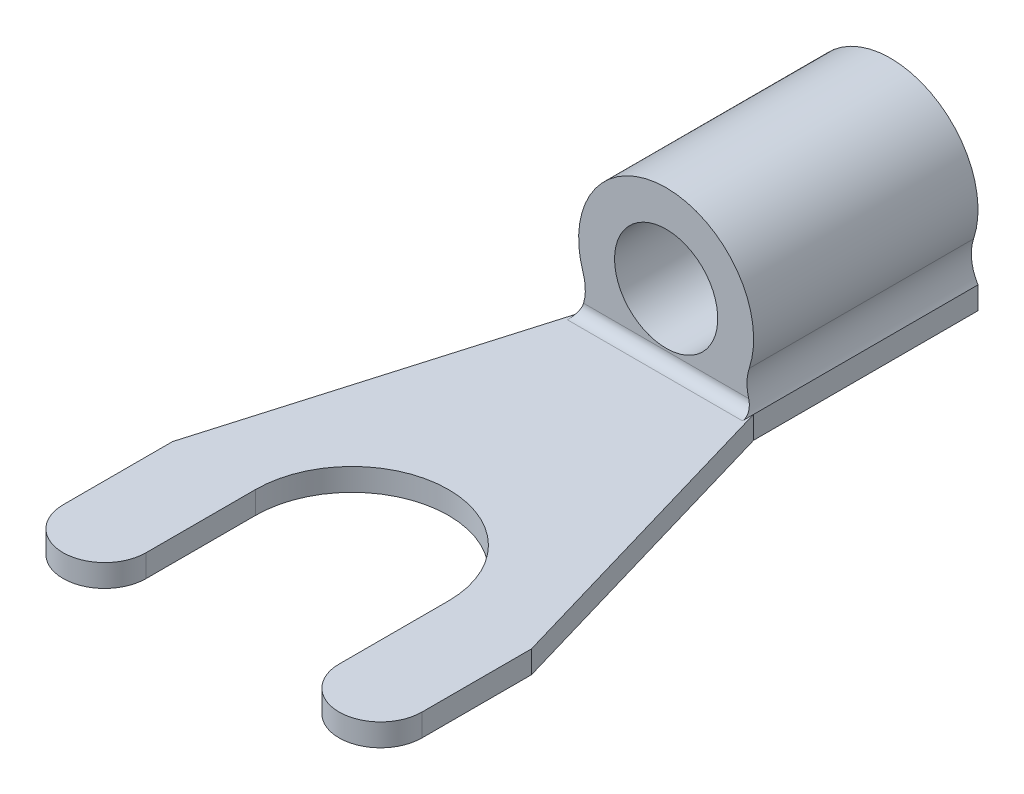
ISO-10303-21;
HEADER;
FILE_DESCRIPTION(('STEP AP214'),'2;1');
FILE_NAME('part.step','',(''),(''),'','','');
FILE_SCHEMA(('AUTOMOTIVE_DESIGN { 1 0 10303 214 1 1 1 1 }'));
ENDSEC;
DATA;
#1=APPLICATION_CONTEXT('core data for automotive mechanical design processes');
#2=APPLICATION_PROTOCOL_DEFINITION('international standard','automotive_design',2000,#1);
#3=PRODUCT_CONTEXT('',#1,'mechanical');
#4=PRODUCT('Part','Part','',(#3));
#5=PRODUCT_RELATED_PRODUCT_CATEGORY('part','',(#4));
#6=PRODUCT_DEFINITION_FORMATION('','',#4);
#7=PRODUCT_DEFINITION_CONTEXT('part definition',#1,'design');
#8=PRODUCT_DEFINITION('design','',#6,#7);
#9=PRODUCT_DEFINITION_SHAPE('','',#8);
#10=(LENGTH_UNIT() NAMED_UNIT(*) SI_UNIT(.MILLI.,.METRE.));
#11=(NAMED_UNIT(*) PLANE_ANGLE_UNIT() SI_UNIT($,.RADIAN.));
#12=(NAMED_UNIT(*) SI_UNIT($,.STERADIAN.) SOLID_ANGLE_UNIT());
#13=UNCERTAINTY_MEASURE_WITH_UNIT(LENGTH_MEASURE(1.E-05),#10,'distance_accuracy_value','');
#14=(GEOMETRIC_REPRESENTATION_CONTEXT(3) GLOBAL_UNCERTAINTY_ASSIGNED_CONTEXT((#13)) GLOBAL_UNIT_ASSIGNED_CONTEXT((#10,
#11,#12)) REPRESENTATION_CONTEXT('',''));
#15=CARTESIAN_POINT('',(0.,0.,0.));
#16=DIRECTION('',(0.,0.,1.));
#17=DIRECTION('',(1.,0.,0.));
#18=AXIS2_PLACEMENT_3D('',#15,#16,#17);
#19=CARTESIAN_POINT('',(-17.8518164707155,-12.39497293494,184.830362795075));
#20=DIRECTION('',(-1.,0.,0.));
#21=DIRECTION('',(0.,0.,1.));
#22=AXIS2_PLACEMENT_3D('',#19,#20,#21);
#23=CYLINDRICAL_SURFACE('',#22,0.25);
#24=DIRECTION('',(-1.,0.,0.));
#25=VECTOR('',#24,1.);
#26=CARTESIAN_POINT('',(-17.8518164707155,-12.39497293494,184.580362795075));
#27=LINE('',#26,#25);
#28=CARTESIAN_POINT('',(-16.0121147430241,-12.39497293494,184.580362795075));
#29=VERTEX_POINT('',#28);
#30=CARTESIAN_POINT('',(-19.691518198407,-12.39497293494,184.580362795075));
#31=VERTEX_POINT('',#30);
#32=EDGE_CURVE('E156',#29,#31,#27,.T.);
#33=ORIENTED_EDGE('',*,*,#32,.T.);
#34=CARTESIAN_POINT('',(-19.8018164707156,-12.64497293494,184.830362795075));
#35=CARTESIAN_POINT('',(-19.8018349927325,-12.6449894328581,184.817570142876));
#36=CARTESIAN_POINT('',(-19.8012116684408,-12.6439923351435,184.804799489349));
#37=CARTESIAN_POINT('',(-19.7988337437832,-12.6401132034944,184.779727326436));
#38=CARTESIAN_POINT('',(-19.7970855808868,-12.6372418943593,184.767423566683));
#39=CARTESIAN_POINT('',(-19.7926110260285,-12.6297600230375,184.74357719183));
#40=CARTESIAN_POINT('',(-19.789886276328,-12.6251523800636,184.732033337193));
#41=CARTESIAN_POINT('',(-19.7836747861377,-12.6143845328763,184.709904926417));
#42=CARTESIAN_POINT('',(-19.7801870435434,-12.6082222852197,184.699321658009));
#43=CARTESIAN_POINT('',(-19.7723885116579,-12.5940178253139,184.678535926885));
#44=CARTESIAN_POINT('',(-19.7680354544514,-12.5858687735941,184.668422601686));
#45=CARTESIAN_POINT('',(-19.758963473874,-12.5682088581191,184.649654392703));
#46=CARTESIAN_POINT('',(-19.7542443749778,-12.5586973391563,184.641000215004));
#47=CARTESIAN_POINT('',(-19.7440540767601,-12.5372088015942,184.62426236939));
#48=CARTESIAN_POINT('',(-19.7385640711199,-12.5250720270503,184.616394399563));
#49=CARTESIAN_POINT('',(-19.7276992950494,-12.4995918327456,184.602847934426));
#50=CARTESIAN_POINT('',(-19.7223244778042,-12.4862489151499,184.597168533065));
#51=CARTESIAN_POINT('',(-19.7124799520318,-12.4600973711964,184.588645199829));
#52=CARTESIAN_POINT('',(-19.707974353849,-12.4473786179252,184.585566982954));
#53=CARTESIAN_POINT('',(-19.6993894524078,-12.4214642011762,184.581422570374));
#54=CARTESIAN_POINT('',(-19.6953106222314,-12.408268029819,184.580358585627));
#55=CARTESIAN_POINT('',(-19.691518198407,-12.39497293494,184.580362795075));
#56=B_SPLINE_CURVE_WITH_KNOTS('',3,(#34,#35,#36,#37,#38,#39,#40,#41,#42,#43,#44,#45,#46,#47,#48,
#49,#50,#51,#52,#53,#54,#55),.UNSPECIFIED.,.F.,.F.,(4,2,2,2,2,2,2,2,2,2,4),(0.,
0.0382893069018732,0.0763614093332975,0.114369786533513,0.152428386377287,0.193361552979245,
0.234314470757119,0.280522325949232,0.326711030823084,0.368073046255088,0.409480437175451),.UNSPECIFIED.);
#57=CARTESIAN_POINT('',(-19.8018164707156,-12.64497293494,184.830362795075));
#58=VERTEX_POINT('',#57);
#59=EDGE_CURVE('E40',#58,#31,#56,.T.);
#60=ORIENTED_EDGE('',*,*,#59,.F.);
#61=DIRECTION('',(1.,0.,0.));
#62=VECTOR('',#61,1.);
#63=CARTESIAN_POINT('',(-17.8518164707155,-12.64497293494,184.830362795075));
#64=LINE('',#63,#62);
#65=CARTESIAN_POINT('',(-15.9018164707155,-12.64497293494,184.830362795075));
#66=VERTEX_POINT('',#65);
#67=EDGE_CURVE('E153',#66,#58,#64,.F.);
#68=ORIENTED_EDGE('',*,*,#67,.F.);
#69=CARTESIAN_POINT('',(-16.0121147430241,-12.39497293494,184.580362795075));
#70=CARTESIAN_POINT('',(-16.0078761505968,-12.4098451381497,184.580356274));
#71=CARTESIAN_POINT('',(-16.0032751001696,-12.4245902749962,184.58168852066));
#72=CARTESIAN_POINT('',(-15.9935663406919,-12.4534221676546,184.586853884942));
#73=CARTESIAN_POINT('',(-15.9884599853089,-12.4675105413361,184.590680466472));
#74=CARTESIAN_POINT('',(-15.9779411647647,-12.494689150805,184.600653368463));
#75=CARTESIAN_POINT('',(-15.9725290891962,-12.5077806091616,184.606796790747));
#76=CARTESIAN_POINT('',(-15.9616442840161,-12.5327098951477,184.621230999046));
#77=CARTESIAN_POINT('',(-15.9561715035853,-12.5445465684715,184.629523738524));
#78=CARTESIAN_POINT('',(-15.9452498907144,-12.5671215219745,184.648455009797));
#79=CARTESIAN_POINT('',(-15.9398105969283,-12.5777977078572,184.659173460593));
#80=CARTESIAN_POINT('',(-15.9295718025825,-12.597165129548,184.682550664264));
#81=CARTESIAN_POINT('',(-15.924772267461,-12.6058564726014,184.695209312244));
#82=CARTESIAN_POINT('',(-15.9164554193761,-12.6205238966397,184.721537853493));
#83=CARTESIAN_POINT('',(-15.9128874505239,-12.6266106686319,184.735129586804));
#84=CARTESIAN_POINT('',(-15.90711977162,-12.6363051415058,184.763424969605));
#85=CARTESIAN_POINT('',(-15.9049159364692,-12.6399203199117,184.778125114532));
#86=CARTESIAN_POINT('',(-15.9029651406894,-12.6431064240035,184.799236527183));
#87=CARTESIAN_POINT('',(-15.9025355816201,-12.6438053194982,184.805433809102));
#88=CARTESIAN_POINT('',(-15.9019611387333,-12.6447384616291,184.817873563688));
#89=CARTESIAN_POINT('',(-15.9018161301016,-12.6449729119884,184.824116015334));
#90=CARTESIAN_POINT('',(-15.9018164707155,-12.64497293494,184.830362795075));
#91=B_SPLINE_CURVE_WITH_KNOTS('',3,(#69,#70,#71,#72,#73,#74,#75,#76,#77,#78,#79,#80,#81,#82,#83,
#84,#85,#86,#87,#88,#89,#90),.UNSPECIFIED.,.F.,.F.,(4,2,2,2,2,2,2,2,2,2,4),(0.,
0.0462989373863122,0.0924770392758487,0.138597566715187,0.184760159896985,0.232751610935657,
0.280740468279888,0.326416072227263,0.371952870974996,0.390686940772957,0.409412791278961),.UNSPECIFIED.);
#92=EDGE_CURVE('E161',#29,#66,#91,.T.);
#93=ORIENTED_EDGE('',*,*,#92,.F.);
#94=EDGE_LOOP('',(#33,#60,#68,#93));
#95=FACE_BOUND('',#94,.T.);
#96=ADVANCED_FACE('F36',(#95),#23,.F.);
#97=CARTESIAN_POINT('',(-17.8518164707155,-11.19497293494,184.580362795075));
#98=DIRECTION('',(0.,0.,-1.));
#99=DIRECTION('',(-1.,0.,0.));
#100=AXIS2_PLACEMENT_3D('',#97,#98,#99);
#101=CYLINDRICAL_SURFACE('',#100,1.15);
#102=CARTESIAN_POINT('',(-17.8518164707155,-11.19497293494,179.930362795101));
#103=DIRECTION('',(0.,0.,-1.));
#104=DIRECTION('',(-1.,0.,0.));
#105=AXIS2_PLACEMENT_3D('',#102,#103,#104);
#106=CIRCLE('',#105,1.14999999999554);
#107=CARTESIAN_POINT('',(-19.0018164707111,-11.19497293494,179.930362795101));
#108=VERTEX_POINT('',#107);
#109=EDGE_CURVE('E245',#108,#108,#106,.T.);
#110=ORIENTED_EDGE('',*,*,#109,.T.);
#111=EDGE_LOOP('',(#110));
#112=FACE_BOUND('',#111,.T.);
#113=CARTESIAN_POINT('',(-17.8518164707155,-11.19497293494,184.580362795075));
#114=DIRECTION('',(0.,0.,-1.));
#115=DIRECTION('',(-1.,0.,0.));
#116=AXIS2_PLACEMENT_3D('',#113,#114,#115);
#117=CIRCLE('',#116,1.15);
#118=CARTESIAN_POINT('',(-19.0018164707155,-11.19497293494,184.580362795075));
#119=VERTEX_POINT('',#118);
#120=EDGE_CURVE('E171',#119,#119,#117,.F.);
#121=ORIENTED_EDGE('',*,*,#120,.T.);
#122=EDGE_LOOP('',(#121));
#123=FACE_BOUND('',#122,.T.);
#124=ADVANCED_FACE('F299',(#112,#123),#101,.F.);
#125=CARTESIAN_POINT('',(-17.8518164707155,-11.19497293494,184.580362795075));
#126=DIRECTION('',(0.,0.,-1.));
#127=DIRECTION('',(-1.,0.,0.));
#128=AXIS2_PLACEMENT_3D('',#125,#126,#127);
#129=PLANE('',#128);
#130=ORIENTED_EDGE('',*,*,#120,.F.);
#131=EDGE_LOOP('',(#130));
#132=FACE_BOUND('',#131,.T.);
#133=ORIENTED_EDGE('',*,*,#32,.F.);
#134=CARTESIAN_POINT('',(-15.0506327160756,-12.1201051269759,184.580362795075));
#135=DIRECTION('',(0.,0.,1.));
#136=DIRECTION('',(1.,0.,0.));
#137=AXIS2_PLACEMENT_3D('',#134,#135,#136);
#138=CIRCLE('',#137,1.);
#139=CARTESIAN_POINT('',(-16.0001865312078,-11.8065009940824,184.580362795075));
#140=VERTEX_POINT('',#139);
#141=EDGE_CURVE('E212',#29,#140,#138,.F.);
#142=ORIENTED_EDGE('',*,*,#141,.T.);
#143=CARTESIAN_POINT('',(-17.8518164707155,-11.19497293494,184.580362795075));
#144=DIRECTION('',(0.,0.,-1.));
#145=DIRECTION('',(-1.,0.,0.));
#146=AXIS2_PLACEMENT_3D('',#143,#144,#145);
#147=CIRCLE('',#146,1.95);
#148=CARTESIAN_POINT('',(-19.7034464102233,-11.8065009940824,184.580362795075));
#149=VERTEX_POINT('',#148);
#150=EDGE_CURVE('E182',#149,#140,#147,.T.);
#151=ORIENTED_EDGE('',*,*,#150,.F.);
#152=CARTESIAN_POINT('',(-20.6530002253555,-12.1201051269759,184.580362795075));
#153=DIRECTION('',(0.,0.,-1.));
#154=DIRECTION('',(-1.,0.,0.));
#155=AXIS2_PLACEMENT_3D('',#152,#153,#154);
#156=CIRCLE('',#155,1.);
#157=EDGE_CURVE('E244',#31,#149,#156,.F.);
#158=ORIENTED_EDGE('',*,*,#157,.F.);
#159=EDGE_LOOP('',(#133,#142,#151,#158));
#160=FACE_BOUND('',#159,.T.);
#161=ADVANCED_FACE('F297',(#132,#160),#129,.F.);
#162=CARTESIAN_POINT('',(-17.8518164707155,-12.64497293494,191.580362795075));
#163=DIRECTION('',(0.,1.,0.));
#164=DIRECTION('',(1.,0.,0.));
#165=AXIS2_PLACEMENT_3D('',#162,#163,#164);
#166=PLANE('',#165);
#167=DIRECTION('',(0.281052751161895,0.,0.959692321040619));
#168=VECTOR('',#167,1.);
#169=CARTESIAN_POINT('',(-14.1677790664582,-12.64497293494,190.501466126686));
#170=LINE('',#169,#168);
#171=CARTESIAN_POINT('',(-13.8518164707155,-12.64497293494,191.580362795075));
#172=VERTEX_POINT('',#171);
#173=CARTESIAN_POINT('',(-15.9018164707155,-12.64497293494,184.580362795075));
#174=VERTEX_POINT('',#173);
#175=EDGE_CURVE('E218',#172,#174,#170,.F.);
#176=ORIENTED_EDGE('',*,*,#175,.T.);
#177=DIRECTION('',(0.,0.,1.));
#178=VECTOR('',#177,1.);
#179=CARTESIAN_POINT('',(-15.9018164707155,-12.64497293494,191.580362795075));
#180=LINE('',#179,#178);
#181=EDGE_CURVE('E169',#174,#66,#180,.T.);
#182=ORIENTED_EDGE('',*,*,#181,.T.);
#183=ORIENTED_EDGE('',*,*,#67,.T.);
#184=DIRECTION('',(0.,0.,-1.));
#185=VECTOR('',#184,1.);
#186=CARTESIAN_POINT('',(-19.8018164707156,-12.64497293494,191.580362795075));
#187=LINE('',#186,#185);
#188=CARTESIAN_POINT('',(-19.8018164707156,-12.64497293494,184.580362795075));
#189=VERTEX_POINT('',#188);
#190=EDGE_CURVE('E167',#58,#189,#187,.T.);
#191=ORIENTED_EDGE('',*,*,#190,.T.);
#192=DIRECTION('',(0.281052751161895,0.,-0.959692321040619));
#193=VECTOR('',#192,1.);
#194=CARTESIAN_POINT('',(-21.5358538749729,-12.64497293494,190.501466126686));
#195=LINE('',#194,#193);
#196=CARTESIAN_POINT('',(-21.8518164707155,-12.64497293494,191.580362795075));
#197=VERTEX_POINT('',#196);
#198=EDGE_CURVE('E176',#189,#197,#195,.F.);
#199=ORIENTED_EDGE('',*,*,#198,.T.);
#200=DIRECTION('',(0.,0.,1.));
#201=VECTOR('',#200,1.);
#202=CARTESIAN_POINT('',(-21.8518164707155,-12.64497293494,191.580362795075));
#203=LINE('',#202,#201);
#204=CARTESIAN_POINT('',(-21.8518164707155,-12.64497293494,194.019624978606));
#205=VERTEX_POINT('',#204);
#206=EDGE_CURVE('E179',#205,#197,#203,.F.);
#207=ORIENTED_EDGE('',*,*,#206,.F.);
#208=CARTESIAN_POINT('',(-20.9268164707155,-12.64497293494,194.019624978606));
#209=DIRECTION('',(0.,-1.,0.));
#210=DIRECTION('',(-1.,0.,0.));
#211=AXIS2_PLACEMENT_3D('',#208,#209,#210);
#212=CIRCLE('',#211,0.925);
#213=CARTESIAN_POINT('',(-20.0018164707156,-12.64497293494,194.019624978606));
#214=VERTEX_POINT('',#213);
#215=EDGE_CURVE('E274',#214,#205,#212,.T.);
#216=ORIENTED_EDGE('',*,*,#215,.F.);
#217=DIRECTION('',(0.,0.,-1.));
#218=VECTOR('',#217,1.);
#219=CARTESIAN_POINT('',(-20.0018164707155,-12.64497293494,191.580362795075));
#220=LINE('',#219,#218);
#221=CARTESIAN_POINT('',(-20.0018164707155,-12.64497293494,191.580362795075));
#222=VERTEX_POINT('',#221);
#223=EDGE_CURVE('E235',#222,#214,#220,.F.);
#224=ORIENTED_EDGE('',*,*,#223,.F.);
#225=CARTESIAN_POINT('',(-17.8518164707155,-12.64497293494,191.580362795075));
#226=DIRECTION('',(0.,-1.,0.));
#227=DIRECTION('',(-1.,0.,0.));
#228=AXIS2_PLACEMENT_3D('',#225,#226,#227);
#229=CIRCLE('',#228,2.15);
#230=CARTESIAN_POINT('',(-15.7018164707156,-12.64497293494,191.580362795075));
#231=VERTEX_POINT('',#230);
#232=EDGE_CURVE('E271',#222,#231,#229,.T.);
#233=ORIENTED_EDGE('',*,*,#232,.T.);
#234=DIRECTION('',(0.,0.,-1.));
#235=VECTOR('',#234,1.);
#236=CARTESIAN_POINT('',(-15.7018164707156,-12.64497293494,191.580362795075));
#237=LINE('',#236,#235);
#238=CARTESIAN_POINT('',(-15.7018164707155,-12.64497293494,194.019624978606));
#239=VERTEX_POINT('',#238);
#240=EDGE_CURVE('E230',#231,#239,#237,.F.);
#241=ORIENTED_EDGE('',*,*,#240,.T.);
#242=CARTESIAN_POINT('',(-14.7768164707155,-12.64497293494,194.019624978606));
#243=DIRECTION('',(0.,-1.,0.));
#244=DIRECTION('',(-1.,0.,0.));
#245=AXIS2_PLACEMENT_3D('',#242,#243,#244);
#246=CIRCLE('',#245,0.925);
#247=CARTESIAN_POINT('',(-13.8518164707155,-12.64497293494,194.019624978606));
#248=VERTEX_POINT('',#247);
#249=EDGE_CURVE('E233',#248,#239,#246,.T.);
#250=ORIENTED_EDGE('',*,*,#249,.F.);
#251=DIRECTION('',(0.,0.,1.));
#252=VECTOR('',#251,1.);
#253=CARTESIAN_POINT('',(-13.8518164707155,-12.64497293494,191.580362795075));
#254=LINE('',#253,#252);
#255=EDGE_CURVE('E225',#248,#172,#254,.F.);
#256=ORIENTED_EDGE('',*,*,#255,.T.);
#257=EDGE_LOOP('',(#176,#182,#183,#191,#199,#207,#216,#224,#233,#241,#250,#256));
#258=FACE_BOUND('',#257,.T.);
#259=ADVANCED_FACE('F165',(#258),#166,.T.);
#260=CARTESIAN_POINT('',(-15.0506327160756,-12.1201051269759,191.580362795075));
#261=DIRECTION('',(0.,0.,1.));
#262=DIRECTION('',(1.,0.,0.));
#263=AXIS2_PLACEMENT_3D('',#260,#261,#262);
#264=CYLINDRICAL_SURFACE('',#263,1.);
#265=ORIENTED_EDGE('',*,*,#92,.T.);
#266=ORIENTED_EDGE('',*,*,#181,.F.);
#267=DIRECTION('',(0.,0.,1.));
#268=VECTOR('',#267,1.);
#269=CARTESIAN_POINT('',(-15.9018164707155,-12.64497293494,191.580362795075));
#270=LINE('',#269,#268);
#271=CARTESIAN_POINT('',(-15.9018164707155,-12.64497293494,179.580362795075));
#272=VERTEX_POINT('',#271);
#273=EDGE_CURVE('E199',#174,#272,#270,.F.);
#274=ORIENTED_EDGE('',*,*,#273,.T.);
#275=CARTESIAN_POINT('',(-15.0506327160756,-12.1201051269759,179.580362795075));
#276=DIRECTION('',(0.,0.,1.));
#277=DIRECTION('',(1.,0.,0.));
#278=AXIS2_PLACEMENT_3D('',#275,#276,#277);
#279=CIRCLE('',#278,1.);
#280=CARTESIAN_POINT('',(-16.0001865312078,-11.8065009940824,179.580362795075));
#281=VERTEX_POINT('',#280);
#282=EDGE_CURVE('E213',#281,#272,#279,.T.);
#283=ORIENTED_EDGE('',*,*,#282,.F.);
#284=DIRECTION('',(0.,0.,1.));
#285=VECTOR('',#284,1.);
#286=CARTESIAN_POINT('',(-16.0001865312078,-11.8065009940824,191.580362795075));
#287=LINE('',#286,#285);
#288=EDGE_CURVE('E170',#140,#281,#287,.F.);
#289=ORIENTED_EDGE('',*,*,#288,.F.);
#290=ORIENTED_EDGE('',*,*,#141,.F.);
#291=EDGE_LOOP('',(#265,#266,#274,#283,#289,#290));
#292=FACE_BOUND('',#291,.T.);
#293=ADVANCED_FACE('F287',(#292),#264,.F.);
#294=CARTESIAN_POINT('',(-17.8518164707155,-11.19497293494,179.580362795132));
#295=DIRECTION('',(0.,0.,-1.));
#296=DIRECTION('',(-1.,0.,0.));
#297=AXIS2_PLACEMENT_3D('',#294,#295,#296);
#298=CONICAL_SURFACE('',#297,1.49999999996453,0.785398163397448);
#299=CARTESIAN_POINT('',(-17.8518164707155,-11.19497293494,179.580362795075));
#300=DIRECTION('',(0.,0.,-1.));
#301=DIRECTION('',(-1.,0.,0.));
#302=AXIS2_PLACEMENT_3D('',#299,#300,#301);
#303=CIRCLE('',#302,1.50000000002137);
#304=CARTESIAN_POINT('',(-19.3518164707369,-11.19497293494,179.580362795075));
#305=VERTEX_POINT('',#304);
#306=EDGE_CURVE('E202',#305,#305,#303,.T.);
#307=ORIENTED_EDGE('',*,*,#306,.T.);
#308=EDGE_LOOP('',(#307));
#309=FACE_BOUND('',#308,.T.);
#310=ORIENTED_EDGE('',*,*,#109,.F.);
#311=EDGE_LOOP('',(#310));
#312=FACE_BOUND('',#311,.T.);
#313=ADVANCED_FACE('F292',(#309,#312),#298,.F.);
#314=CARTESIAN_POINT('',(-17.8518164707155,-11.19497293494,184.580362795075));
#315=DIRECTION('',(0.,0.,-1.));
#316=DIRECTION('',(-1.,0.,0.));
#317=AXIS2_PLACEMENT_3D('',#314,#315,#316);
#318=CYLINDRICAL_SURFACE('',#317,1.95);
#319=CARTESIAN_POINT('',(-17.8518164707155,-11.19497293494,179.580362795075));
#320=DIRECTION('',(0.,0.,-1.));
#321=DIRECTION('',(-1.,0.,0.));
#322=AXIS2_PLACEMENT_3D('',#319,#320,#321);
#323=CIRCLE('',#322,1.95);
#324=CARTESIAN_POINT('',(-19.7034464102233,-11.8065009940824,179.580362795075));
#325=VERTEX_POINT('',#324);
#326=EDGE_CURVE('E264',#281,#325,#323,.F.);
#327=ORIENTED_EDGE('',*,*,#326,.T.);
#328=DIRECTION('',(0.,0.,-1.));
#329=VECTOR('',#328,1.);
#330=CARTESIAN_POINT('',(-19.7034464102233,-11.8065009940824,191.580362795075));
#331=LINE('',#330,#329);
#332=EDGE_CURVE('E177',#325,#149,#331,.F.);
#333=ORIENTED_EDGE('',*,*,#332,.T.);
#334=ORIENTED_EDGE('',*,*,#150,.T.);
#335=ORIENTED_EDGE('',*,*,#288,.T.);
#336=EDGE_LOOP('',(#327,#333,#334,#335));
#337=FACE_BOUND('',#336,.T.);
#338=ADVANCED_FACE('F365',(#337),#318,.T.);
#339=CARTESIAN_POINT('',(-20.6530002253555,-12.1201051269759,191.580362795075));
#340=DIRECTION('',(0.,0.,-1.));
#341=DIRECTION('',(-1.,0.,0.));
#342=AXIS2_PLACEMENT_3D('',#339,#340,#341);
#343=CYLINDRICAL_SURFACE('',#342,1.);
#344=DIRECTION('',(0.,0.,-1.));
#345=VECTOR('',#344,1.);
#346=CARTESIAN_POINT('',(-19.8018164707156,-12.64497293494,191.580362795075));
#347=LINE('',#346,#345);
#348=CARTESIAN_POINT('',(-19.8018164707156,-12.64497293494,179.580362795075));
#349=VERTEX_POINT('',#348);
#350=EDGE_CURVE('E175',#349,#189,#347,.F.);
#351=ORIENTED_EDGE('',*,*,#350,.T.);
#352=ORIENTED_EDGE('',*,*,#190,.F.);
#353=ORIENTED_EDGE('',*,*,#59,.T.);
#354=ORIENTED_EDGE('',*,*,#157,.T.);
#355=ORIENTED_EDGE('',*,*,#332,.F.);
#356=CARTESIAN_POINT('',(-20.6530002253555,-12.1201051269759,179.580362795075));
#357=DIRECTION('',(0.,0.,-1.));
#358=DIRECTION('',(-1.,0.,0.));
#359=AXIS2_PLACEMENT_3D('',#356,#357,#358);
#360=CIRCLE('',#359,1.);
#361=EDGE_CURVE('E191',#325,#349,#360,.T.);
#362=ORIENTED_EDGE('',*,*,#361,.T.);
#363=EDGE_LOOP('',(#351,#352,#353,#354,#355,#362));
#364=FACE_BOUND('',#363,.T.);
#365=ADVANCED_FACE('F174',(#364),#343,.F.);
#366=CARTESIAN_POINT('',(-21.5358538749729,-12.64497293494,190.501466126686));
#367=DIRECTION('',(0.959692321040619,0.,0.281052751161895));
#368=DIRECTION('',(0.281052751161895,0.,-0.959692321040619));
#369=AXIS2_PLACEMENT_3D('',#366,#367,#368);
#370=PLANE('',#369);
#371=DIRECTION('',(0.,1.,0.));
#372=VECTOR('',#371,1.);
#373=CARTESIAN_POINT('',(-21.8518164707155,-12.64497293494,191.580362795075));
#374=LINE('',#373,#372);
#375=CARTESIAN_POINT('',(-21.8518164707155,-13.14497293494,191.580362795075));
#376=VERTEX_POINT('',#375);
#377=EDGE_CURVE('E240',#197,#376,#374,.F.);
#378=ORIENTED_EDGE('',*,*,#377,.F.);
#379=ORIENTED_EDGE('',*,*,#198,.F.);
#380=DIRECTION('',(0.,1.,0.));
#381=VECTOR('',#380,1.);
#382=CARTESIAN_POINT('',(-19.8018164707156,-12.64497293494,184.580362795075));
#383=LINE('',#382,#381);
#384=CARTESIAN_POINT('',(-19.8018164707156,-13.14497293494,184.580362795075));
#385=VERTEX_POINT('',#384);
#386=EDGE_CURVE('E411',#189,#385,#383,.F.);
#387=ORIENTED_EDGE('',*,*,#386,.T.);
#388=DIRECTION('',(-0.281052751161895,0.,0.959692321040619));
#389=VECTOR('',#388,1.);
#390=CARTESIAN_POINT('',(-19.8018164707156,-13.14497293494,184.580362795075));
#391=LINE('',#390,#389);
#392=EDGE_CURVE('E408',#385,#376,#391,.T.);
#393=ORIENTED_EDGE('',*,*,#392,.T.);
#394=EDGE_LOOP('',(#378,#379,#387,#393));
#395=FACE_BOUND('',#394,.T.);
#396=ADVANCED_FACE('F359',(#395),#370,.F.);
#397=CARTESIAN_POINT('',(-21.8518164707155,-12.64497293494,191.580362795075));
#398=DIRECTION('',(-1.,0.,0.));
#399=DIRECTION('',(0.,0.,1.));
#400=AXIS2_PLACEMENT_3D('',#397,#398,#399);
#401=PLANE('',#400);
#402=ORIENTED_EDGE('',*,*,#206,.T.);
#403=ORIENTED_EDGE('',*,*,#377,.T.);
#404=DIRECTION('',(0.,0.,-1.));
#405=VECTOR('',#404,1.);
#406=CARTESIAN_POINT('',(-21.8518164707155,-13.14497293494,191.580362795075));
#407=LINE('',#406,#405);
#408=CARTESIAN_POINT('',(-21.8518164707155,-13.14497293494,194.019624978606));
#409=VERTEX_POINT('',#408);
#410=EDGE_CURVE('E262',#376,#409,#407,.F.);
#411=ORIENTED_EDGE('',*,*,#410,.T.);
#412=DIRECTION('',(0.,-1.,0.));
#413=VECTOR('',#412,1.);
#414=CARTESIAN_POINT('',(-21.8518164707155,-12.64497293494,194.019624978606));
#415=LINE('',#414,#413);
#416=EDGE_CURVE('E238',#205,#409,#415,.T.);
#417=ORIENTED_EDGE('',*,*,#416,.F.);
#418=EDGE_LOOP('',(#402,#403,#411,#417));
#419=FACE_BOUND('',#418,.T.);
#420=ADVANCED_FACE('F355',(#419),#401,.T.);
#421=CARTESIAN_POINT('',(-20.9268164707155,-12.64497293494,194.019624978606));
#422=DIRECTION('',(0.,-1.,0.));
#423=DIRECTION('',(-1.,0.,0.));
#424=AXIS2_PLACEMENT_3D('',#421,#422,#423);
#425=CYLINDRICAL_SURFACE('',#424,0.925);
#426=ORIENTED_EDGE('',*,*,#215,.T.);
#427=ORIENTED_EDGE('',*,*,#416,.T.);
#428=CARTESIAN_POINT('',(-20.9268164707155,-13.14497293494,194.019624978606));
#429=DIRECTION('',(0.,-1.,0.));
#430=DIRECTION('',(-1.,0.,0.));
#431=AXIS2_PLACEMENT_3D('',#428,#429,#430);
#432=CIRCLE('',#431,0.925);
#433=CARTESIAN_POINT('',(-20.0018164707156,-13.14497293494,194.019624978606));
#434=VERTEX_POINT('',#433);
#435=EDGE_CURVE('E259',#409,#434,#432,.F.);
#436=ORIENTED_EDGE('',*,*,#435,.T.);
#437=DIRECTION('',(0.,1.,0.));
#438=VECTOR('',#437,1.);
#439=CARTESIAN_POINT('',(-20.0018164707156,-12.64497293494,194.019624978606));
#440=LINE('',#439,#438);
#441=EDGE_CURVE('E237',#214,#434,#440,.F.);
#442=ORIENTED_EDGE('',*,*,#441,.F.);
#443=EDGE_LOOP('',(#426,#427,#436,#442));
#444=FACE_BOUND('',#443,.T.);
#445=ADVANCED_FACE('F351',(#444),#425,.T.);
#446=CARTESIAN_POINT('',(-20.0018164707155,-12.64497293494,191.580362795075));
#447=DIRECTION('',(1.,0.,0.));
#448=DIRECTION('',(0.,0.,-1.));
#449=AXIS2_PLACEMENT_3D('',#446,#447,#448);
#450=PLANE('',#449);
#451=ORIENTED_EDGE('',*,*,#223,.T.);
#452=ORIENTED_EDGE('',*,*,#441,.T.);
#453=DIRECTION('',(0.,0.,-1.));
#454=VECTOR('',#453,1.);
#455=CARTESIAN_POINT('',(-20.0018164707155,-13.14497293494,191.580362795075));
#456=LINE('',#455,#454);
#457=CARTESIAN_POINT('',(-20.0018164707155,-13.14497293494,191.580362795075));
#458=VERTEX_POINT('',#457);
#459=EDGE_CURVE('E258',#434,#458,#456,.T.);
#460=ORIENTED_EDGE('',*,*,#459,.T.);
#461=DIRECTION('',(0.,-1.,0.));
#462=VECTOR('',#461,1.);
#463=CARTESIAN_POINT('',(-20.0018164707155,-12.64497293494,191.580362795075));
#464=LINE('',#463,#462);
#465=EDGE_CURVE('E273',#458,#222,#464,.F.);
#466=ORIENTED_EDGE('',*,*,#465,.T.);
#467=EDGE_LOOP('',(#451,#452,#460,#466));
#468=FACE_BOUND('',#467,.T.);
#469=ADVANCED_FACE('F347',(#468),#450,.T.);
#470=CARTESIAN_POINT('',(-17.8518164707155,-12.64497293494,191.580362795075));
#471=DIRECTION('',(0.,-1.,0.));
#472=DIRECTION('',(-1.,0.,0.));
#473=AXIS2_PLACEMENT_3D('',#470,#471,#472);
#474=CYLINDRICAL_SURFACE('',#473,2.15);
#475=DIRECTION('',(0.,1.,0.));
#476=VECTOR('',#475,1.);
#477=CARTESIAN_POINT('',(-15.7018164707156,-12.64497293494,191.580362795075));
#478=LINE('',#477,#476);
#479=CARTESIAN_POINT('',(-15.7018164707156,-13.14497293494,191.580362795075));
#480=VERTEX_POINT('',#479);
#481=EDGE_CURVE('E234',#480,#231,#478,.T.);
#482=ORIENTED_EDGE('',*,*,#481,.T.);
#483=ORIENTED_EDGE('',*,*,#232,.F.);
#484=ORIENTED_EDGE('',*,*,#465,.F.);
#485=CARTESIAN_POINT('',(-17.8518164707155,-13.14497293494,191.580362795075));
#486=DIRECTION('',(0.,-1.,0.));
#487=DIRECTION('',(-1.,0.,0.));
#488=AXIS2_PLACEMENT_3D('',#485,#486,#487);
#489=CIRCLE('',#488,2.15);
#490=EDGE_CURVE('E255',#458,#480,#489,.T.);
#491=ORIENTED_EDGE('',*,*,#490,.T.);
#492=EDGE_LOOP('',(#482,#483,#484,#491));
#493=FACE_BOUND('',#492,.T.);
#494=ADVANCED_FACE('F343',(#493),#474,.F.);
#495=CARTESIAN_POINT('',(-15.7018164707156,-12.64497293494,191.580362795075));
#496=DIRECTION('',(1.,0.,0.));
#497=DIRECTION('',(0.,0.,-1.));
#498=AXIS2_PLACEMENT_3D('',#495,#496,#497);
#499=PLANE('',#498);
#500=DIRECTION('',(0.,-1.,0.));
#501=VECTOR('',#500,1.);
#502=CARTESIAN_POINT('',(-15.7018164707155,-12.64497293494,194.019624978606));
#503=LINE('',#502,#501);
#504=CARTESIAN_POINT('',(-15.7018164707155,-13.14497293494,194.019624978606));
#505=VERTEX_POINT('',#504);
#506=EDGE_CURVE('E270',#239,#505,#503,.T.);
#507=ORIENTED_EDGE('',*,*,#506,.F.);
#508=ORIENTED_EDGE('',*,*,#240,.F.);
#509=ORIENTED_EDGE('',*,*,#481,.F.);
#510=DIRECTION('',(0.,0.,-1.));
#511=VECTOR('',#510,1.);
#512=CARTESIAN_POINT('',(-15.7018164707156,-13.14497293494,191.580362795075));
#513=LINE('',#512,#511);
#514=EDGE_CURVE('E254',#480,#505,#513,.F.);
#515=ORIENTED_EDGE('',*,*,#514,.T.);
#516=EDGE_LOOP('',(#507,#508,#509,#515));
#517=FACE_BOUND('',#516,.T.);
#518=ADVANCED_FACE('F339',(#517),#499,.F.);
#519=CARTESIAN_POINT('',(-14.7768164707155,-12.64497293494,194.019624978606));
#520=DIRECTION('',(0.,-1.,0.));
#521=DIRECTION('',(-1.,0.,0.));
#522=AXIS2_PLACEMENT_3D('',#519,#520,#521);
#523=CYLINDRICAL_SURFACE('',#522,0.925);
#524=ORIENTED_EDGE('',*,*,#249,.T.);
#525=ORIENTED_EDGE('',*,*,#506,.T.);
#526=CARTESIAN_POINT('',(-14.7768164707155,-13.14497293494,194.019624978606));
#527=DIRECTION('',(0.,-1.,0.));
#528=DIRECTION('',(-1.,0.,0.));
#529=AXIS2_PLACEMENT_3D('',#526,#527,#528);
#530=CIRCLE('',#529,0.925);
#531=CARTESIAN_POINT('',(-13.8518164707155,-13.14497293494,194.019624978606));
#532=VERTEX_POINT('',#531);
#533=EDGE_CURVE('E250',#505,#532,#530,.F.);
#534=ORIENTED_EDGE('',*,*,#533,.T.);
#535=DIRECTION('',(0.,1.,0.));
#536=VECTOR('',#535,1.);
#537=CARTESIAN_POINT('',(-13.8518164707155,-12.64497293494,194.019624978606));
#538=LINE('',#537,#536);
#539=EDGE_CURVE('E227',#532,#248,#538,.T.);
#540=ORIENTED_EDGE('',*,*,#539,.T.);
#541=EDGE_LOOP('',(#524,#525,#534,#540));
#542=FACE_BOUND('',#541,.T.);
#543=ADVANCED_FACE('F335',(#542),#523,.T.);
#544=CARTESIAN_POINT('',(-13.8518164707155,-12.64497293494,191.580362795075));
#545=DIRECTION('',(-1.,0.,0.));
#546=DIRECTION('',(0.,0.,1.));
#547=AXIS2_PLACEMENT_3D('',#544,#545,#546);
#548=PLANE('',#547);
#549=DIRECTION('',(0.,1.,0.));
#550=VECTOR('',#549,1.);
#551=CARTESIAN_POINT('',(-13.8518164707155,-12.64497293494,191.580362795075));
#552=LINE('',#551,#550);
#553=CARTESIAN_POINT('',(-13.8518164707155,-13.14497293494,191.580362795075));
#554=VERTEX_POINT('',#553);
#555=EDGE_CURVE('E222',#554,#172,#552,.T.);
#556=ORIENTED_EDGE('',*,*,#555,.T.);
#557=ORIENTED_EDGE('',*,*,#255,.F.);
#558=ORIENTED_EDGE('',*,*,#539,.F.);
#559=DIRECTION('',(0.,0.,-1.));
#560=VECTOR('',#559,1.);
#561=CARTESIAN_POINT('',(-13.8518164707155,-13.14497293494,191.580362795075));
#562=LINE('',#561,#560);
#563=EDGE_CURVE('E253',#532,#554,#562,.T.);
#564=ORIENTED_EDGE('',*,*,#563,.T.);
#565=EDGE_LOOP('',(#556,#557,#558,#564));
#566=FACE_BOUND('',#565,.T.);
#567=ADVANCED_FACE('F331',(#566),#548,.F.);
#568=CARTESIAN_POINT('',(-14.1677790664582,-12.64497293494,190.501466126686));
#569=DIRECTION('',(-0.959692321040619,0.,0.281052751161895));
#570=DIRECTION('',(0.281052751161895,0.,0.959692321040619));
#571=AXIS2_PLACEMENT_3D('',#568,#569,#570);
#572=PLANE('',#571);
#573=DIRECTION('',(0.,1.,0.));
#574=VECTOR('',#573,1.);
#575=CARTESIAN_POINT('',(-15.9018164707155,-12.64497293494,184.580362795075));
#576=LINE('',#575,#574);
#577=CARTESIAN_POINT('',(-15.9018164707155,-13.14497293494,184.580362795075));
#578=VERTEX_POINT('',#577);
#579=EDGE_CURVE('E203',#578,#174,#576,.T.);
#580=ORIENTED_EDGE('',*,*,#579,.T.);
#581=ORIENTED_EDGE('',*,*,#175,.F.);
#582=ORIENTED_EDGE('',*,*,#555,.F.);
#583=DIRECTION('',(-0.281052751161895,0.,-0.959692321040619));
#584=VECTOR('',#583,1.);
#585=CARTESIAN_POINT('',(-13.8518164707155,-13.14497293494,191.580362795075));
#586=LINE('',#585,#584);
#587=EDGE_CURVE('E208',#554,#578,#586,.T.);
#588=ORIENTED_EDGE('',*,*,#587,.T.);
#589=EDGE_LOOP('',(#580,#581,#582,#588));
#590=FACE_BOUND('',#589,.T.);
#591=ADVANCED_FACE('F327',(#590),#572,.F.);
#592=CARTESIAN_POINT('',(-15.9018164707155,-12.64497293494,191.580362795075));
#593=DIRECTION('',(-1.,0.,0.));
#594=DIRECTION('',(0.,0.,1.));
#595=AXIS2_PLACEMENT_3D('',#592,#593,#594);
#596=PLANE('',#595);
#597=DIRECTION('',(0.,1.,0.));
#598=VECTOR('',#597,1.);
#599=CARTESIAN_POINT('',(-15.9018164707155,-12.64497293494,179.580362795075));
#600=LINE('',#599,#598);
#601=CARTESIAN_POINT('',(-15.9018164707155,-13.14497293494,179.580362795075));
#602=VERTEX_POINT('',#601);
#603=EDGE_CURVE('E266',#602,#272,#600,.T.);
#604=ORIENTED_EDGE('',*,*,#603,.T.);
#605=ORIENTED_EDGE('',*,*,#273,.F.);
#606=ORIENTED_EDGE('',*,*,#579,.F.);
#607=DIRECTION('',(0.,0.,-1.));
#608=VECTOR('',#607,1.);
#609=CARTESIAN_POINT('',(-15.9018164707155,-13.14497293494,191.580362795075));
#610=LINE('',#609,#608);
#611=EDGE_CURVE('E196',#578,#602,#610,.T.);
#612=ORIENTED_EDGE('',*,*,#611,.T.);
#613=EDGE_LOOP('',(#604,#605,#606,#612));
#614=FACE_BOUND('',#613,.T.);
#615=ADVANCED_FACE('F323',(#614),#596,.F.);
#616=CARTESIAN_POINT('',(-17.8518164707155,-12.64497293494,179.580362795075));
#617=DIRECTION('',(0.,0.,1.));
#618=DIRECTION('',(1.,0.,0.));
#619=AXIS2_PLACEMENT_3D('',#616,#617,#618);
#620=PLANE('',#619);
#621=DIRECTION('',(0.,1.,0.));
#622=VECTOR('',#621,1.);
#623=CARTESIAN_POINT('',(-19.8018164707156,-12.64497293494,179.580362795075));
#624=LINE('',#623,#622);
#625=CARTESIAN_POINT('',(-19.8018164707156,-13.14497293494,179.580362795075));
#626=VERTEX_POINT('',#625);
#627=EDGE_CURVE('E59',#626,#349,#624,.T.);
#628=ORIENTED_EDGE('',*,*,#627,.T.);
#629=ORIENTED_EDGE('',*,*,#361,.F.);
#630=ORIENTED_EDGE('',*,*,#326,.F.);
#631=ORIENTED_EDGE('',*,*,#282,.T.);
#632=ORIENTED_EDGE('',*,*,#603,.F.);
#633=DIRECTION('',(1.,0.,0.));
#634=VECTOR('',#633,1.);
#635=CARTESIAN_POINT('',(-17.8518164707155,-13.14497293494,179.580362795075));
#636=LINE('',#635,#634);
#637=EDGE_CURVE('E51',#602,#626,#636,.F.);
#638=ORIENTED_EDGE('',*,*,#637,.T.);
#639=EDGE_LOOP('',(#628,#629,#630,#631,#632,#638));
#640=FACE_BOUND('',#639,.T.);
#641=ORIENTED_EDGE('',*,*,#306,.F.);
#642=EDGE_LOOP('',(#641));
#643=FACE_BOUND('',#642,.T.);
#644=ADVANCED_FACE('F317',(#640,#643),#620,.F.);
#645=CARTESIAN_POINT('',(-19.8018164707156,-12.64497293494,191.580362795075));
#646=DIRECTION('',(1.,0.,0.));
#647=DIRECTION('',(0.,0.,-1.));
#648=AXIS2_PLACEMENT_3D('',#645,#646,#647);
#649=PLANE('',#648);
#650=ORIENTED_EDGE('',*,*,#386,.F.);
#651=ORIENTED_EDGE('',*,*,#350,.F.);
#652=ORIENTED_EDGE('',*,*,#627,.F.);
#653=DIRECTION('',(0.,0.,-1.));
#654=VECTOR('',#653,1.);
#655=CARTESIAN_POINT('',(-19.8018164707156,-13.14497293494,191.580362795075));
#656=LINE('',#655,#654);
#657=EDGE_CURVE('E11',#626,#385,#656,.F.);
#658=ORIENTED_EDGE('',*,*,#657,.T.);
#659=EDGE_LOOP('',(#650,#651,#652,#658));
#660=FACE_BOUND('',#659,.T.);
#661=ADVANCED_FACE('F310',(#660),#649,.F.);
#662=CARTESIAN_POINT('',(-17.8518164707155,-13.14497293494,191.580362795075));
#663=DIRECTION('',(0.,1.,0.));
#664=DIRECTION('',(1.,0.,0.));
#665=AXIS2_PLACEMENT_3D('',#662,#663,#664);
#666=PLANE('',#665);
#667=ORIENTED_EDGE('',*,*,#637,.F.);
#668=ORIENTED_EDGE('',*,*,#611,.F.);
#669=ORIENTED_EDGE('',*,*,#587,.F.);
#670=ORIENTED_EDGE('',*,*,#563,.F.);
#671=ORIENTED_EDGE('',*,*,#533,.F.);
#672=ORIENTED_EDGE('',*,*,#514,.F.);
#673=ORIENTED_EDGE('',*,*,#490,.F.);
#674=ORIENTED_EDGE('',*,*,#459,.F.);
#675=ORIENTED_EDGE('',*,*,#435,.F.);
#676=ORIENTED_EDGE('',*,*,#410,.F.);
#677=ORIENTED_EDGE('',*,*,#392,.F.);
#678=ORIENTED_EDGE('',*,*,#657,.F.);
#679=EDGE_LOOP('',(#667,#668,#669,#670,#671,#672,#673,#674,#675,#676,#677,#678));
#680=FACE_BOUND('',#679,.T.);
#681=ADVANCED_FACE('F308',(#680),#666,.F.);
#682=CLOSED_SHELL('',(#96,#124,#161,#259,#293,#313,#338,#365,#396,#420,#445,#469,#494,#518,#543,
#567,#591,#615,#644,#661,#681));
#683=MANIFOLD_SOLID_BREP('B2',#682);
#684=ADVANCED_BREP_SHAPE_REPRESENTATION('',(#18,#683),#14);
#685=SHAPE_DEFINITION_REPRESENTATION(#9,#684);
ENDSEC;
END-ISO-10303-21;
